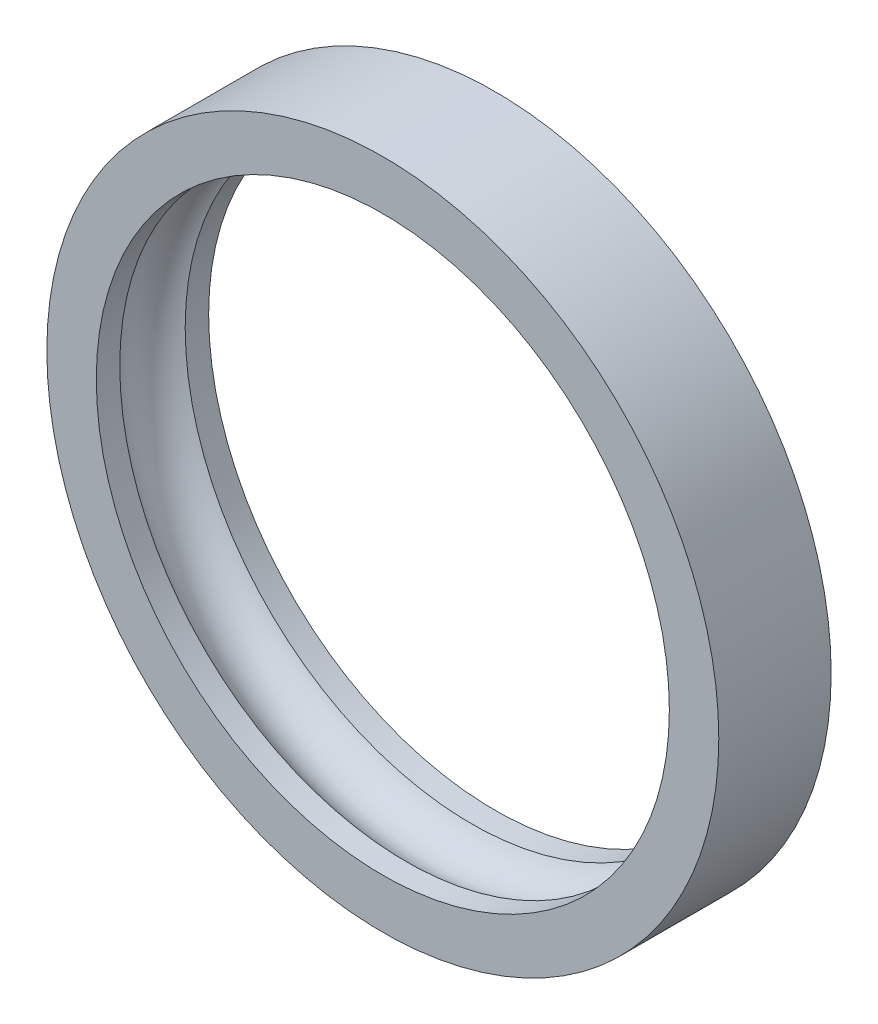
ISO-10303-21;
HEADER;
FILE_DESCRIPTION(('STEP AP214'),'2;1');
FILE_NAME('part.step','',(''),(''),'','','');
FILE_SCHEMA(('AUTOMOTIVE_DESIGN { 1 0 10303 214 1 1 1 1 }'));
ENDSEC;
DATA;
#1=APPLICATION_CONTEXT('core data for automotive mechanical design processes');
#2=APPLICATION_PROTOCOL_DEFINITION('international standard','automotive_design',2000,#1);
#3=PRODUCT_CONTEXT('',#1,'mechanical');
#4=PRODUCT('Part','Part','',(#3));
#5=PRODUCT_RELATED_PRODUCT_CATEGORY('part','',(#4));
#6=PRODUCT_DEFINITION_FORMATION('','',#4);
#7=PRODUCT_DEFINITION_CONTEXT('part definition',#1,'design');
#8=PRODUCT_DEFINITION('design','',#6,#7);
#9=PRODUCT_DEFINITION_SHAPE('','',#8);
#10=(LENGTH_UNIT() NAMED_UNIT(*) SI_UNIT(.MILLI.,.METRE.));
#11=(NAMED_UNIT(*) PLANE_ANGLE_UNIT() SI_UNIT($,.RADIAN.));
#12=(NAMED_UNIT(*) SI_UNIT($,.STERADIAN.) SOLID_ANGLE_UNIT());
#13=UNCERTAINTY_MEASURE_WITH_UNIT(LENGTH_MEASURE(1.E-05),#10,'distance_accuracy_value','');
#14=(GEOMETRIC_REPRESENTATION_CONTEXT(3) GLOBAL_UNCERTAINTY_ASSIGNED_CONTEXT((#13)) GLOBAL_UNIT_ASSIGNED_CONTEXT((#10,
#11,#12)) REPRESENTATION_CONTEXT('',''));
#15=CARTESIAN_POINT('',(0.,0.,0.));
#16=DIRECTION('',(0.,0.,1.));
#17=DIRECTION('',(1.,0.,0.));
#18=AXIS2_PLACEMENT_3D('',#15,#16,#17);
#19=CARTESIAN_POINT('',(0.,0.,-0.000999999999999265));
#20=DIRECTION('',(0.,0.,1.));
#21=DIRECTION('',(1.,0.,0.));
#22=AXIS2_PLACEMENT_3D('',#19,#20,#21);
#23=CYLINDRICAL_SURFACE('',#22,25.5);
#24=CARTESIAN_POINT('',(0.,0.,2.08870733178541));
#25=DIRECTION('',(0.,0.,1.));
#26=DIRECTION('',(1.,0.,0.));
#27=AXIS2_PLACEMENT_3D('',#24,#25,#26);
#28=CIRCLE('',#27,25.5);
#29=CARTESIAN_POINT('',(25.5,0.,2.08870733178541));
#30=VERTEX_POINT('',#29);
#31=EDGE_CURVE('E36',#30,#30,#28,.T.);
#32=ORIENTED_EDGE('',*,*,#31,.T.);
#33=EDGE_LOOP('',(#32));
#34=FACE_BOUND('',#33,.T.);
#35=CARTESIAN_POINT('',(0.,0.,0.));
#36=DIRECTION('',(0.,0.,1.));
#37=DIRECTION('',(1.,0.,0.));
#38=AXIS2_PLACEMENT_3D('',#35,#36,#37);
#39=CIRCLE('',#38,25.5);
#40=CARTESIAN_POINT('',(25.5,0.,0.));
#41=VERTEX_POINT('',#40);
#42=EDGE_CURVE('E45',#41,#41,#39,.F.);
#43=ORIENTED_EDGE('',*,*,#42,.T.);
#44=EDGE_LOOP('',(#43));
#45=FACE_BOUND('',#44,.T.);
#46=ADVANCED_FACE('F32',(#34,#45),#23,.F.);
#47=CARTESIAN_POINT('',(0.,0.,94.5699710299111));
#48=DIRECTION('',(0.,0.,-1.));
#49=DIRECTION('',(-1.,0.,0.));
#50=AXIS2_PLACEMENT_3D('',#47,#48,#49);
#51=CYLINDRICAL_SURFACE('',#50,29.9);
#52=CARTESIAN_POINT('',(0.,0.,0.));
#53=DIRECTION('',(0.,0.,1.));
#54=DIRECTION('',(1.,0.,0.));
#55=AXIS2_PLACEMENT_3D('',#52,#53,#54);
#56=CIRCLE('',#55,29.9);
#57=CARTESIAN_POINT('',(29.9,0.,0.));
#58=VERTEX_POINT('',#57);
#59=EDGE_CURVE('E40',#58,#58,#56,.T.);
#60=ORIENTED_EDGE('',*,*,#59,.T.);
#61=EDGE_LOOP('',(#60));
#62=FACE_BOUND('',#61,.T.);
#63=CARTESIAN_POINT('',(0.,0.,9.99999999999999));
#64=DIRECTION('',(0.,0.,1.));
#65=DIRECTION('',(1.,0.,0.));
#66=AXIS2_PLACEMENT_3D('',#63,#64,#65);
#67=CIRCLE('',#66,29.9);
#68=CARTESIAN_POINT('',(29.9,0.,9.99999999999999));
#69=VERTEX_POINT('',#68);
#70=EDGE_CURVE('E10',#69,#69,#67,.T.);
#71=ORIENTED_EDGE('',*,*,#70,.F.);
#72=EDGE_LOOP('',(#71));
#73=FACE_BOUND('',#72,.T.);
#74=ADVANCED_FACE('F67',(#62,#73),#51,.T.);
#75=CARTESIAN_POINT('',(0.,0.,0.));
#76=DIRECTION('',(0.,0.,1.));
#77=DIRECTION('',(1.,0.,0.));
#78=AXIS2_PLACEMENT_3D('',#75,#76,#77);
#79=PLANE('',#78);
#80=ORIENTED_EDGE('',*,*,#42,.F.);
#81=EDGE_LOOP('',(#80));
#82=FACE_BOUND('',#81,.T.);
#83=ORIENTED_EDGE('',*,*,#59,.F.);
#84=EDGE_LOOP('',(#83));
#85=FACE_BOUND('',#84,.T.);
#86=ADVANCED_FACE('F64',(#82,#85),#79,.F.);
#87=CARTESIAN_POINT('',(0.,0.,10.));
#88=DIRECTION('',(0.,0.,1.));
#89=DIRECTION('',(1.,0.,0.));
#90=AXIS2_PLACEMENT_3D('',#87,#88,#89);
#91=PLANE('',#90);
#92=CARTESIAN_POINT('',(0.,0.,10.));
#93=DIRECTION('',(0.,0.,1.));
#94=DIRECTION('',(1.,0.,0.));
#95=AXIS2_PLACEMENT_3D('',#92,#93,#94);
#96=CIRCLE('',#95,25.5);
#97=CARTESIAN_POINT('',(25.5,0.,10.));
#98=VERTEX_POINT('',#97);
#99=EDGE_CURVE('E53',#98,#98,#96,.T.);
#100=ORIENTED_EDGE('',*,*,#99,.F.);
#101=EDGE_LOOP('',(#100));
#102=FACE_BOUND('',#101,.T.);
#103=ORIENTED_EDGE('',*,*,#70,.T.);
#104=EDGE_LOOP('',(#103));
#105=FACE_BOUND('',#104,.T.);
#106=ADVANCED_FACE('F34',(#102,#105),#91,.T.);
#107=CARTESIAN_POINT('',(0.,0.,7.91129266821459));
#108=DIRECTION('',(0.,0.,-1.));
#109=DIRECTION('',(-1.,0.,0.));
#110=AXIS2_PLACEMENT_3D('',#107,#108,#109);
#111=CIRCLE('',#110,25.5);
#112=CARTESIAN_POINT('',(-25.5,0.,7.91129266821459));
#113=VERTEX_POINT('',#112);
#114=EDGE_CURVE('E48',#113,#113,#111,.T.);
#115=ORIENTED_EDGE('',*,*,#114,.T.);
#116=EDGE_LOOP('',(#115));
#117=FACE_BOUND('',#116,.T.);
#118=ORIENTED_EDGE('',*,*,#99,.T.);
#119=EDGE_LOOP('',(#118));
#120=FACE_BOUND('',#119,.T.);
#121=ADVANCED_FACE('F77',(#117,#120),#23,.F.);
#122=CARTESIAN_POINT('',(0.,0.,5.));
#123=DIRECTION('',(0.,0.,-1.));
#124=DIRECTION('',(-1.,0.,0.));
#125=AXIS2_PLACEMENT_3D('',#122,#123,#124);
#126=TOROIDAL_SURFACE('',#125,24.,3.27500000000001);
#127=ORIENTED_EDGE('',*,*,#114,.F.);
#128=EDGE_LOOP('',(#127));
#129=FACE_BOUND('',#128,.T.);
#130=ORIENTED_EDGE('',*,*,#31,.F.);
#131=EDGE_LOOP('',(#130));
#132=FACE_BOUND('',#131,.T.);
#133=ADVANCED_FACE('F80',(#129,#132),#126,.F.);
#134=CLOSED_SHELL('',(#46,#74,#86,#106,#121,#133));
#135=MANIFOLD_SOLID_BREP('B2',#134);
#136=ADVANCED_BREP_SHAPE_REPRESENTATION('',(#18,#135),#14);
#137=SHAPE_DEFINITION_REPRESENTATION(#9,#136);
ENDSEC;
END-ISO-10303-21;
